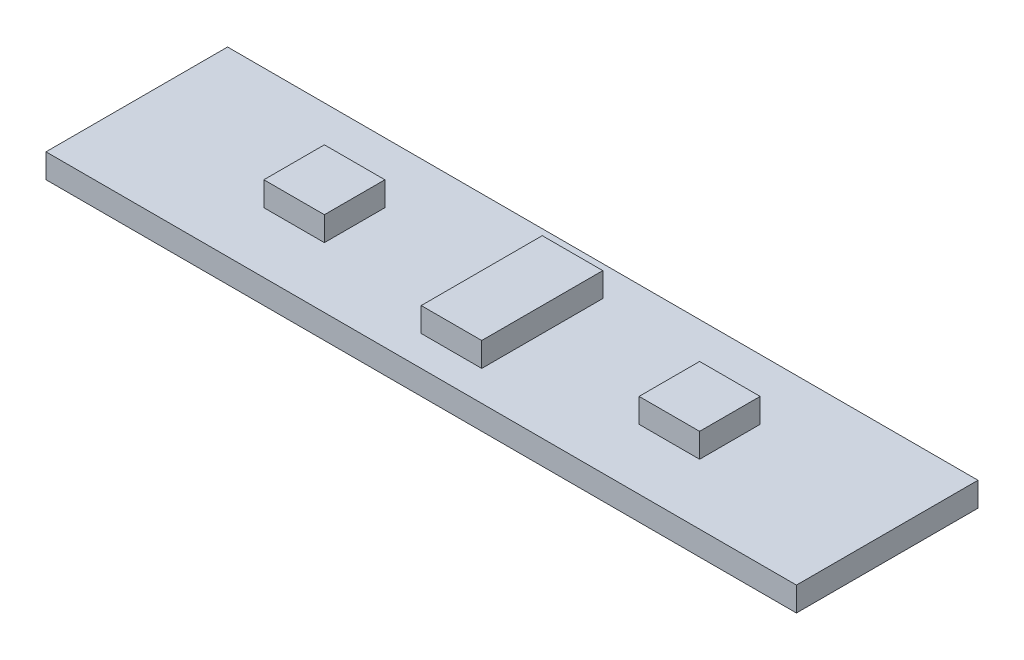
ISO-10303-21;
HEADER;
FILE_DESCRIPTION(('STEP AP214'),'2;1');
FILE_NAME('part.step','',(''),(''),'','','');
FILE_SCHEMA(('AUTOMOTIVE_DESIGN { 1 0 10303 214 1 1 1 1 }'));
ENDSEC;
DATA;
#1=APPLICATION_CONTEXT('core data for automotive mechanical design processes');
#2=APPLICATION_PROTOCOL_DEFINITION('international standard','automotive_design',2000,#1);
#3=PRODUCT_CONTEXT('',#1,'mechanical');
#4=PRODUCT('Part','Part','',(#3));
#5=PRODUCT_RELATED_PRODUCT_CATEGORY('part','',(#4));
#6=PRODUCT_DEFINITION_FORMATION('','',#4);
#7=PRODUCT_DEFINITION_CONTEXT('part definition',#1,'design');
#8=PRODUCT_DEFINITION('design','',#6,#7);
#9=PRODUCT_DEFINITION_SHAPE('','',#8);
#10=(LENGTH_UNIT() NAMED_UNIT(*) SI_UNIT(.MILLI.,.METRE.));
#11=(NAMED_UNIT(*) PLANE_ANGLE_UNIT() SI_UNIT($,.RADIAN.));
#12=(NAMED_UNIT(*) SI_UNIT($,.STERADIAN.) SOLID_ANGLE_UNIT());
#13=UNCERTAINTY_MEASURE_WITH_UNIT(LENGTH_MEASURE(1.E-05),#10,'distance_accuracy_value','');
#14=(GEOMETRIC_REPRESENTATION_CONTEXT(3) GLOBAL_UNCERTAINTY_ASSIGNED_CONTEXT((#13)) GLOBAL_UNIT_ASSIGNED_CONTEXT((#10,
#11,#12)) REPRESENTATION_CONTEXT('',''));
#15=CARTESIAN_POINT('',(0.,0.,0.));
#16=DIRECTION('',(0.,0.,1.));
#17=DIRECTION('',(1.,0.,0.));
#18=AXIS2_PLACEMENT_3D('',#15,#16,#17);
#19=CARTESIAN_POINT('',(0.,2.,-15.));
#20=DIRECTION('',(0.,-1.,0.));
#21=DIRECTION('',(0.,0.,-1.));
#22=AXIS2_PLACEMENT_3D('',#19,#20,#21);
#23=PLANE('',#22);
#24=DIRECTION('',(0.,0.,-1.));
#25=VECTOR('',#24,1.);
#26=CARTESIAN_POINT('',(49.,2.,-10.));
#27=LINE('',#26,#25);
#28=CARTESIAN_POINT('',(49.,2.,-5.));
#29=VERTEX_POINT('',#28);
#30=CARTESIAN_POINT('',(49.,2.,-10.));
#31=VERTEX_POINT('',#30);
#32=EDGE_CURVE('E179',#29,#31,#27,.T.);
#33=ORIENTED_EDGE('',*,*,#32,.F.);
#34=DIRECTION('',(1.,0.,0.));
#35=VECTOR('',#34,1.);
#36=CARTESIAN_POINT('',(49.,2.,-5.));
#37=LINE('',#36,#35);
#38=CARTESIAN_POINT('',(44.,2.,-5.));
#39=VERTEX_POINT('',#38);
#40=EDGE_CURVE('E192',#39,#29,#37,.T.);
#41=ORIENTED_EDGE('',*,*,#40,.F.);
#42=DIRECTION('',(0.,0.,1.));
#43=VECTOR('',#42,1.);
#44=CARTESIAN_POINT('',(44.,2.,-10.));
#45=LINE('',#44,#43);
#46=CARTESIAN_POINT('',(44.,2.,-10.));
#47=VERTEX_POINT('',#46);
#48=EDGE_CURVE('E201',#47,#39,#45,.T.);
#49=ORIENTED_EDGE('',*,*,#48,.F.);
#50=DIRECTION('',(-1.,0.,0.));
#51=VECTOR('',#50,1.);
#52=CARTESIAN_POINT('',(49.,2.,-10.));
#53=LINE('',#52,#51);
#54=EDGE_CURVE('E182',#31,#47,#53,.T.);
#55=ORIENTED_EDGE('',*,*,#54,.F.);
#56=EDGE_LOOP('',(#33,#41,#49,#55));
#57=FACE_BOUND('',#56,.T.);
#58=DIRECTION('',(0.,0.,1.));
#59=VECTOR('',#58,1.);
#60=CARTESIAN_POINT('',(0.,2.,0.));
#61=LINE('',#60,#59);
#62=CARTESIAN_POINT('',(0.,2.,-15.));
#63=VERTEX_POINT('',#62);
#64=CARTESIAN_POINT('',(0.,2.,0.));
#65=VERTEX_POINT('',#64);
#66=EDGE_CURVE('E251',#63,#65,#61,.T.);
#67=ORIENTED_EDGE('',*,*,#66,.T.);
#68=DIRECTION('',(1.,0.,0.));
#69=VECTOR('',#68,1.);
#70=CARTESIAN_POINT('',(0.,2.,0.));
#71=LINE('',#70,#69);
#72=CARTESIAN_POINT('',(62.,2.,0.));
#73=VERTEX_POINT('',#72);
#74=EDGE_CURVE('E254',#65,#73,#71,.T.);
#75=ORIENTED_EDGE('',*,*,#74,.T.);
#76=DIRECTION('',(0.,0.,-1.));
#77=VECTOR('',#76,1.);
#78=CARTESIAN_POINT('',(62.,2.,0.));
#79=LINE('',#78,#77);
#80=CARTESIAN_POINT('',(62.,2.,-15.));
#81=VERTEX_POINT('',#80);
#82=EDGE_CURVE('E257',#73,#81,#79,.T.);
#83=ORIENTED_EDGE('',*,*,#82,.T.);
#84=DIRECTION('',(-1.,0.,0.));
#85=VECTOR('',#84,1.);
#86=CARTESIAN_POINT('',(0.,2.,-15.));
#87=LINE('',#86,#85);
#88=EDGE_CURVE('E259',#81,#63,#87,.T.);
#89=ORIENTED_EDGE('',*,*,#88,.T.);
#90=EDGE_LOOP('',(#67,#75,#83,#89));
#91=FACE_BOUND('',#90,.T.);
#92=DIRECTION('',(0.,0.,1.));
#93=VECTOR('',#92,1.);
#94=CARTESIAN_POINT('',(13.,2.,-10.));
#95=LINE('',#94,#93);
#96=CARTESIAN_POINT('',(13.,2.,-10.));
#97=VERTEX_POINT('',#96);
#98=CARTESIAN_POINT('',(13.,2.,-5.));
#99=VERTEX_POINT('',#98);
#100=EDGE_CURVE('E217',#97,#99,#95,.T.);
#101=ORIENTED_EDGE('',*,*,#100,.F.);
#102=DIRECTION('',(-1.,0.,0.));
#103=VECTOR('',#102,1.);
#104=CARTESIAN_POINT('',(13.,2.,-10.));
#105=LINE('',#104,#103);
#106=CARTESIAN_POINT('',(18.,2.,-10.));
#107=VERTEX_POINT('',#106);
#108=EDGE_CURVE('E222',#107,#97,#105,.T.);
#109=ORIENTED_EDGE('',*,*,#108,.F.);
#110=DIRECTION('',(0.,0.,-1.));
#111=VECTOR('',#110,1.);
#112=CARTESIAN_POINT('',(18.,2.,-10.));
#113=LINE('',#112,#111);
#114=CARTESIAN_POINT('',(18.,2.,-5.));
#115=VERTEX_POINT('',#114);
#116=EDGE_CURVE('E234',#115,#107,#113,.T.);
#117=ORIENTED_EDGE('',*,*,#116,.F.);
#118=DIRECTION('',(1.,0.,0.));
#119=VECTOR('',#118,1.);
#120=CARTESIAN_POINT('',(13.,2.,-5.));
#121=LINE('',#120,#119);
#122=EDGE_CURVE('E231',#99,#115,#121,.T.);
#123=ORIENTED_EDGE('',*,*,#122,.F.);
#124=EDGE_LOOP('',(#101,#109,#117,#123));
#125=FACE_BOUND('',#124,.T.);
#126=DIRECTION('',(0.,0.,-1.));
#127=VECTOR('',#126,1.);
#128=CARTESIAN_POINT('',(33.5,2.,-12.5));
#129=LINE('',#128,#127);
#130=CARTESIAN_POINT('',(33.5,2.,-2.5));
#131=VERTEX_POINT('',#130);
#132=CARTESIAN_POINT('',(33.5,2.,-12.5));
#133=VERTEX_POINT('',#132);
#134=EDGE_CURVE('E510',#131,#133,#129,.T.);
#135=ORIENTED_EDGE('',*,*,#134,.F.);
#136=DIRECTION('',(1.,0.,0.));
#137=VECTOR('',#136,1.);
#138=CARTESIAN_POINT('',(31.,2.,-2.5));
#139=LINE('',#138,#137);
#140=CARTESIAN_POINT('',(28.5,2.,-2.5));
#141=VERTEX_POINT('',#140);
#142=EDGE_CURVE('E175',#141,#131,#139,.T.);
#143=ORIENTED_EDGE('',*,*,#142,.F.);
#144=DIRECTION('',(0.,0.,1.));
#145=VECTOR('',#144,1.);
#146=CARTESIAN_POINT('',(28.5,2.,-2.5));
#147=LINE('',#146,#145);
#148=CARTESIAN_POINT('',(28.5,2.,-12.5));
#149=VERTEX_POINT('',#148);
#150=EDGE_CURVE('E65',#149,#141,#147,.T.);
#151=ORIENTED_EDGE('',*,*,#150,.F.);
#152=DIRECTION('',(-1.,0.,0.));
#153=VECTOR('',#152,1.);
#154=CARTESIAN_POINT('',(28.5,2.,-12.5));
#155=LINE('',#154,#153);
#156=EDGE_CURVE('E60',#133,#149,#155,.T.);
#157=ORIENTED_EDGE('',*,*,#156,.F.);
#158=EDGE_LOOP('',(#135,#143,#151,#157));
#159=FACE_BOUND('',#158,.T.);
#160=ADVANCED_FACE('F45',(#57,#91,#125,#159),#23,.F.);
#161=CARTESIAN_POINT('',(0.,2.,0.));
#162=DIRECTION('',(1.,0.,0.));
#163=DIRECTION('',(0.,0.,-1.));
#164=AXIS2_PLACEMENT_3D('',#161,#162,#163);
#165=PLANE('',#164);
#166=DIRECTION('',(0.,0.,1.));
#167=VECTOR('',#166,1.);
#168=CARTESIAN_POINT('',(0.,0.,0.));
#169=LINE('',#168,#167);
#170=CARTESIAN_POINT('',(0.,0.,-15.));
#171=VERTEX_POINT('',#170);
#172=CARTESIAN_POINT('',(0.,0.,0.));
#173=VERTEX_POINT('',#172);
#174=EDGE_CURVE('E250',#171,#173,#169,.T.);
#175=ORIENTED_EDGE('',*,*,#174,.T.);
#176=DIRECTION('',(0.,-1.,0.));
#177=VECTOR('',#176,1.);
#178=CARTESIAN_POINT('',(0.,2.,0.));
#179=LINE('',#178,#177);
#180=EDGE_CURVE('E11',#65,#173,#179,.T.);
#181=ORIENTED_EDGE('',*,*,#180,.F.);
#182=ORIENTED_EDGE('',*,*,#66,.F.);
#183=DIRECTION('',(0.,-1.,0.));
#184=VECTOR('',#183,1.);
#185=CARTESIAN_POINT('',(0.,2.,-15.));
#186=LINE('',#185,#184);
#187=EDGE_CURVE('E261',#63,#171,#186,.T.);
#188=ORIENTED_EDGE('',*,*,#187,.T.);
#189=EDGE_LOOP('',(#175,#181,#182,#188));
#190=FACE_BOUND('',#189,.T.);
#191=ADVANCED_FACE('F47',(#190),#165,.F.);
#192=CARTESIAN_POINT('',(0.,2.,0.));
#193=DIRECTION('',(0.,0.,-1.));
#194=DIRECTION('',(-1.,0.,0.));
#195=AXIS2_PLACEMENT_3D('',#192,#193,#194);
#196=PLANE('',#195);
#197=DIRECTION('',(1.,0.,0.));
#198=VECTOR('',#197,1.);
#199=CARTESIAN_POINT('',(0.,0.,0.));
#200=LINE('',#199,#198);
#201=CARTESIAN_POINT('',(62.,0.,0.));
#202=VERTEX_POINT('',#201);
#203=EDGE_CURVE('E264',#173,#202,#200,.T.);
#204=ORIENTED_EDGE('',*,*,#203,.T.);
#205=DIRECTION('',(0.,-1.,0.));
#206=VECTOR('',#205,1.);
#207=CARTESIAN_POINT('',(62.,2.,0.));
#208=LINE('',#207,#206);
#209=EDGE_CURVE('E53',#73,#202,#208,.T.);
#210=ORIENTED_EDGE('',*,*,#209,.F.);
#211=ORIENTED_EDGE('',*,*,#74,.F.);
#212=ORIENTED_EDGE('',*,*,#180,.T.);
#213=EDGE_LOOP('',(#204,#210,#211,#212));
#214=FACE_BOUND('',#213,.T.);
#215=ADVANCED_FACE('F294',(#214),#196,.F.);
#216=CARTESIAN_POINT('',(62.,2.,0.));
#217=DIRECTION('',(-1.,0.,0.));
#218=DIRECTION('',(0.,0.,1.));
#219=AXIS2_PLACEMENT_3D('',#216,#217,#218);
#220=PLANE('',#219);
#221=DIRECTION('',(0.,0.,-1.));
#222=VECTOR('',#221,1.);
#223=CARTESIAN_POINT('',(62.,0.,0.));
#224=LINE('',#223,#222);
#225=CARTESIAN_POINT('',(62.,0.,-15.));
#226=VERTEX_POINT('',#225);
#227=EDGE_CURVE('E266',#202,#226,#224,.T.);
#228=ORIENTED_EDGE('',*,*,#227,.T.);
#229=DIRECTION('',(0.,-1.,0.));
#230=VECTOR('',#229,1.);
#231=CARTESIAN_POINT('',(62.,2.,-15.));
#232=LINE('',#231,#230);
#233=EDGE_CURVE('E271',#81,#226,#232,.T.);
#234=ORIENTED_EDGE('',*,*,#233,.F.);
#235=ORIENTED_EDGE('',*,*,#82,.F.);
#236=ORIENTED_EDGE('',*,*,#209,.T.);
#237=EDGE_LOOP('',(#228,#234,#235,#236));
#238=FACE_BOUND('',#237,.T.);
#239=ADVANCED_FACE('F278',(#238),#220,.F.);
#240=CARTESIAN_POINT('',(0.,2.,-15.));
#241=DIRECTION('',(0.,0.,1.));
#242=DIRECTION('',(1.,0.,0.));
#243=AXIS2_PLACEMENT_3D('',#240,#241,#242);
#244=PLANE('',#243);
#245=DIRECTION('',(-1.,0.,0.));
#246=VECTOR('',#245,1.);
#247=CARTESIAN_POINT('',(0.,0.,-15.));
#248=LINE('',#247,#246);
#249=EDGE_CURVE('E255',#226,#171,#248,.T.);
#250=ORIENTED_EDGE('',*,*,#249,.T.);
#251=ORIENTED_EDGE('',*,*,#187,.F.);
#252=ORIENTED_EDGE('',*,*,#88,.F.);
#253=ORIENTED_EDGE('',*,*,#233,.T.);
#254=EDGE_LOOP('',(#250,#251,#252,#253));
#255=FACE_BOUND('',#254,.T.);
#256=ADVANCED_FACE('F287',(#255),#244,.F.);
#257=CARTESIAN_POINT('',(0.,0.,-15.));
#258=DIRECTION('',(0.,-1.,0.));
#259=DIRECTION('',(0.,0.,-1.));
#260=AXIS2_PLACEMENT_3D('',#257,#258,#259);
#261=PLANE('',#260);
#262=ORIENTED_EDGE('',*,*,#174,.F.);
#263=ORIENTED_EDGE('',*,*,#249,.F.);
#264=ORIENTED_EDGE('',*,*,#227,.F.);
#265=ORIENTED_EDGE('',*,*,#203,.F.);
#266=EDGE_LOOP('',(#262,#263,#264,#265));
#267=FACE_BOUND('',#266,.T.);
#268=ADVANCED_FACE('F284',(#267),#261,.T.);
#269=CARTESIAN_POINT('',(13.,4.,-10.));
#270=DIRECTION('',(1.,0.,0.));
#271=DIRECTION('',(0.,0.,-1.));
#272=AXIS2_PLACEMENT_3D('',#269,#270,#271);
#273=PLANE('',#272);
#274=ORIENTED_EDGE('',*,*,#100,.T.);
#275=DIRECTION('',(0.,-1.,0.));
#276=VECTOR('',#275,1.);
#277=CARTESIAN_POINT('',(13.,4.,-5.));
#278=LINE('',#277,#276);
#279=CARTESIAN_POINT('',(13.,4.,-5.));
#280=VERTEX_POINT('',#279);
#281=EDGE_CURVE('E247',#280,#99,#278,.T.);
#282=ORIENTED_EDGE('',*,*,#281,.F.);
#283=DIRECTION('',(0.,0.,1.));
#284=VECTOR('',#283,1.);
#285=CARTESIAN_POINT('',(13.,4.,-10.));
#286=LINE('',#285,#284);
#287=CARTESIAN_POINT('',(13.,4.,-10.));
#288=VERTEX_POINT('',#287);
#289=EDGE_CURVE('E218',#288,#280,#286,.T.);
#290=ORIENTED_EDGE('',*,*,#289,.F.);
#291=DIRECTION('',(0.,-1.,0.));
#292=VECTOR('',#291,1.);
#293=CARTESIAN_POINT('',(13.,4.,-10.));
#294=LINE('',#293,#292);
#295=EDGE_CURVE('E228',#288,#97,#294,.T.);
#296=ORIENTED_EDGE('',*,*,#295,.T.);
#297=EDGE_LOOP('',(#274,#282,#290,#296));
#298=FACE_BOUND('',#297,.T.);
#299=ADVANCED_FACE('F310',(#298),#273,.F.);
#300=CARTESIAN_POINT('',(13.,4.,-5.));
#301=DIRECTION('',(0.,0.,-1.));
#302=DIRECTION('',(-1.,0.,0.));
#303=AXIS2_PLACEMENT_3D('',#300,#301,#302);
#304=PLANE('',#303);
#305=ORIENTED_EDGE('',*,*,#122,.T.);
#306=DIRECTION('',(0.,-1.,0.));
#307=VECTOR('',#306,1.);
#308=CARTESIAN_POINT('',(18.,4.,-5.));
#309=LINE('',#308,#307);
#310=CARTESIAN_POINT('',(18.,4.,-5.));
#311=VERTEX_POINT('',#310);
#312=EDGE_CURVE('E244',#311,#115,#309,.T.);
#313=ORIENTED_EDGE('',*,*,#312,.F.);
#314=DIRECTION('',(1.,0.,0.));
#315=VECTOR('',#314,1.);
#316=CARTESIAN_POINT('',(13.,4.,-5.));
#317=LINE('',#316,#315);
#318=EDGE_CURVE('E221',#280,#311,#317,.T.);
#319=ORIENTED_EDGE('',*,*,#318,.F.);
#320=ORIENTED_EDGE('',*,*,#281,.T.);
#321=EDGE_LOOP('',(#305,#313,#319,#320));
#322=FACE_BOUND('',#321,.T.);
#323=ADVANCED_FACE('F333',(#322),#304,.F.);
#324=CARTESIAN_POINT('',(18.,4.,-10.));
#325=DIRECTION('',(-1.,0.,0.));
#326=DIRECTION('',(0.,0.,1.));
#327=AXIS2_PLACEMENT_3D('',#324,#325,#326);
#328=PLANE('',#327);
#329=ORIENTED_EDGE('',*,*,#116,.T.);
#330=DIRECTION('',(0.,-1.,0.));
#331=VECTOR('',#330,1.);
#332=CARTESIAN_POINT('',(18.,4.,-10.));
#333=LINE('',#332,#331);
#334=CARTESIAN_POINT('',(18.,4.,-10.));
#335=VERTEX_POINT('',#334);
#336=EDGE_CURVE('E241',#335,#107,#333,.T.);
#337=ORIENTED_EDGE('',*,*,#336,.F.);
#338=DIRECTION('',(0.,0.,-1.));
#339=VECTOR('',#338,1.);
#340=CARTESIAN_POINT('',(18.,4.,-10.));
#341=LINE('',#340,#339);
#342=EDGE_CURVE('E224',#311,#335,#341,.T.);
#343=ORIENTED_EDGE('',*,*,#342,.F.);
#344=ORIENTED_EDGE('',*,*,#312,.T.);
#345=EDGE_LOOP('',(#329,#337,#343,#344));
#346=FACE_BOUND('',#345,.T.);
#347=ADVANCED_FACE('F340',(#346),#328,.F.);
#348=CARTESIAN_POINT('',(13.,4.,-10.));
#349=DIRECTION('',(0.,0.,1.));
#350=DIRECTION('',(1.,0.,0.));
#351=AXIS2_PLACEMENT_3D('',#348,#349,#350);
#352=PLANE('',#351);
#353=ORIENTED_EDGE('',*,*,#108,.T.);
#354=ORIENTED_EDGE('',*,*,#295,.F.);
#355=DIRECTION('',(-1.,0.,0.));
#356=VECTOR('',#355,1.);
#357=CARTESIAN_POINT('',(13.,4.,-10.));
#358=LINE('',#357,#356);
#359=EDGE_CURVE('E226',#335,#288,#358,.T.);
#360=ORIENTED_EDGE('',*,*,#359,.F.);
#361=ORIENTED_EDGE('',*,*,#336,.T.);
#362=EDGE_LOOP('',(#353,#354,#360,#361));
#363=FACE_BOUND('',#362,.T.);
#364=ADVANCED_FACE('F348',(#363),#352,.F.);
#365=CARTESIAN_POINT('',(13.,4.,-5.));
#366=DIRECTION('',(0.,1.,0.));
#367=DIRECTION('',(0.,0.,1.));
#368=AXIS2_PLACEMENT_3D('',#365,#366,#367);
#369=PLANE('',#368);
#370=ORIENTED_EDGE('',*,*,#289,.T.);
#371=ORIENTED_EDGE('',*,*,#318,.T.);
#372=ORIENTED_EDGE('',*,*,#342,.T.);
#373=ORIENTED_EDGE('',*,*,#359,.T.);
#374=EDGE_LOOP('',(#370,#371,#372,#373));
#375=FACE_BOUND('',#374,.T.);
#376=ADVANCED_FACE('F357',(#375),#369,.T.);
#377=CARTESIAN_POINT('',(49.,4.,-10.));
#378=DIRECTION('',(-1.,0.,0.));
#379=DIRECTION('',(0.,0.,1.));
#380=AXIS2_PLACEMENT_3D('',#377,#378,#379);
#381=PLANE('',#380);
#382=ORIENTED_EDGE('',*,*,#32,.T.);
#383=DIRECTION('',(0.,-1.,0.));
#384=VECTOR('',#383,1.);
#385=CARTESIAN_POINT('',(49.,4.,-10.));
#386=LINE('',#385,#384);
#387=CARTESIAN_POINT('',(49.,4.,-10.));
#388=VERTEX_POINT('',#387);
#389=EDGE_CURVE('E214',#388,#31,#386,.T.);
#390=ORIENTED_EDGE('',*,*,#389,.F.);
#391=DIRECTION('',(0.,0.,-1.));
#392=VECTOR('',#391,1.);
#393=CARTESIAN_POINT('',(49.,4.,-10.));
#394=LINE('',#393,#392);
#395=CARTESIAN_POINT('',(49.,4.,-5.));
#396=VERTEX_POINT('',#395);
#397=EDGE_CURVE('E188',#396,#388,#394,.T.);
#398=ORIENTED_EDGE('',*,*,#397,.F.);
#399=DIRECTION('',(0.,-1.,0.));
#400=VECTOR('',#399,1.);
#401=CARTESIAN_POINT('',(49.,4.,-5.));
#402=LINE('',#401,#400);
#403=EDGE_CURVE('E197',#396,#29,#402,.T.);
#404=ORIENTED_EDGE('',*,*,#403,.T.);
#405=EDGE_LOOP('',(#382,#390,#398,#404));
#406=FACE_BOUND('',#405,.T.);
#407=ADVANCED_FACE('F364',(#406),#381,.F.);
#408=CARTESIAN_POINT('',(49.,4.,-10.));
#409=DIRECTION('',(0.,0.,1.));
#410=DIRECTION('',(1.,0.,0.));
#411=AXIS2_PLACEMENT_3D('',#408,#409,#410);
#412=PLANE('',#411);
#413=ORIENTED_EDGE('',*,*,#54,.T.);
#414=DIRECTION('',(0.,-1.,0.));
#415=VECTOR('',#414,1.);
#416=CARTESIAN_POINT('',(44.,4.,-10.));
#417=LINE('',#416,#415);
#418=CARTESIAN_POINT('',(44.,4.,-10.));
#419=VERTEX_POINT('',#418);
#420=EDGE_CURVE('E211',#419,#47,#417,.T.);
#421=ORIENTED_EDGE('',*,*,#420,.F.);
#422=DIRECTION('',(-1.,0.,0.));
#423=VECTOR('',#422,1.);
#424=CARTESIAN_POINT('',(49.,4.,-10.));
#425=LINE('',#424,#423);
#426=EDGE_CURVE('E191',#388,#419,#425,.T.);
#427=ORIENTED_EDGE('',*,*,#426,.F.);
#428=ORIENTED_EDGE('',*,*,#389,.T.);
#429=EDGE_LOOP('',(#413,#421,#427,#428));
#430=FACE_BOUND('',#429,.T.);
#431=ADVANCED_FACE('F373',(#430),#412,.F.);
#432=CARTESIAN_POINT('',(44.,4.,-10.));
#433=DIRECTION('',(1.,0.,0.));
#434=DIRECTION('',(0.,0.,-1.));
#435=AXIS2_PLACEMENT_3D('',#432,#433,#434);
#436=PLANE('',#435);
#437=ORIENTED_EDGE('',*,*,#48,.T.);
#438=DIRECTION('',(0.,-1.,0.));
#439=VECTOR('',#438,1.);
#440=CARTESIAN_POINT('',(44.,4.,-5.));
#441=LINE('',#440,#439);
#442=CARTESIAN_POINT('',(44.,4.,-5.));
#443=VERTEX_POINT('',#442);
#444=EDGE_CURVE('E208',#443,#39,#441,.T.);
#445=ORIENTED_EDGE('',*,*,#444,.F.);
#446=DIRECTION('',(0.,0.,1.));
#447=VECTOR('',#446,1.);
#448=CARTESIAN_POINT('',(44.,4.,-10.));
#449=LINE('',#448,#447);
#450=EDGE_CURVE('E194',#419,#443,#449,.T.);
#451=ORIENTED_EDGE('',*,*,#450,.F.);
#452=ORIENTED_EDGE('',*,*,#420,.T.);
#453=EDGE_LOOP('',(#437,#445,#451,#452));
#454=FACE_BOUND('',#453,.T.);
#455=ADVANCED_FACE('F381',(#454),#436,.F.);
#456=CARTESIAN_POINT('',(49.,4.,-5.));
#457=DIRECTION('',(0.,0.,-1.));
#458=DIRECTION('',(-1.,0.,0.));
#459=AXIS2_PLACEMENT_3D('',#456,#457,#458);
#460=PLANE('',#459);
#461=ORIENTED_EDGE('',*,*,#40,.T.);
#462=ORIENTED_EDGE('',*,*,#403,.F.);
#463=DIRECTION('',(1.,0.,0.));
#464=VECTOR('',#463,1.);
#465=CARTESIAN_POINT('',(49.,4.,-5.));
#466=LINE('',#465,#464);
#467=EDGE_CURVE('E196',#443,#396,#466,.T.);
#468=ORIENTED_EDGE('',*,*,#467,.F.);
#469=ORIENTED_EDGE('',*,*,#444,.T.);
#470=EDGE_LOOP('',(#461,#462,#468,#469));
#471=FACE_BOUND('',#470,.T.);
#472=ADVANCED_FACE('F388',(#471),#460,.F.);
#473=CARTESIAN_POINT('',(49.,4.,-5.));
#474=DIRECTION('',(0.,-1.,0.));
#475=DIRECTION('',(0.,0.,-1.));
#476=AXIS2_PLACEMENT_3D('',#473,#474,#475);
#477=PLANE('',#476);
#478=ORIENTED_EDGE('',*,*,#397,.T.);
#479=ORIENTED_EDGE('',*,*,#426,.T.);
#480=ORIENTED_EDGE('',*,*,#450,.T.);
#481=ORIENTED_EDGE('',*,*,#467,.T.);
#482=EDGE_LOOP('',(#478,#479,#480,#481));
#483=FACE_BOUND('',#482,.T.);
#484=ADVANCED_FACE('F396',(#483),#477,.F.);
#485=CARTESIAN_POINT('',(33.5,4.,-12.5));
#486=DIRECTION('',(-1.,0.,0.));
#487=DIRECTION('',(0.,0.,1.));
#488=AXIS2_PLACEMENT_3D('',#485,#486,#487);
#489=PLANE('',#488);
#490=ORIENTED_EDGE('',*,*,#134,.T.);
#491=DIRECTION('',(0.,-1.,0.));
#492=VECTOR('',#491,1.);
#493=CARTESIAN_POINT('',(33.5,4.,-12.5));
#494=LINE('',#493,#492);
#495=CARTESIAN_POINT('',(33.5,4.,-12.5));
#496=VERTEX_POINT('',#495);
#497=EDGE_CURVE('E162',#496,#133,#494,.T.);
#498=ORIENTED_EDGE('',*,*,#497,.F.);
#499=DIRECTION('',(0.,0.,-1.));
#500=VECTOR('',#499,1.);
#501=CARTESIAN_POINT('',(33.5,4.,-12.5));
#502=LINE('',#501,#500);
#503=CARTESIAN_POINT('',(33.5,4.,-2.5));
#504=VERTEX_POINT('',#503);
#505=EDGE_CURVE('E156',#504,#496,#502,.T.);
#506=ORIENTED_EDGE('',*,*,#505,.F.);
#507=DIRECTION('',(0.,-1.,0.));
#508=VECTOR('',#507,1.);
#509=CARTESIAN_POINT('',(33.5,4.,-2.5));
#510=LINE('',#509,#508);
#511=EDGE_CURVE('E160',#504,#131,#510,.T.);
#512=ORIENTED_EDGE('',*,*,#511,.T.);
#513=EDGE_LOOP('',(#490,#498,#506,#512));
#514=FACE_BOUND('',#513,.T.);
#515=ADVANCED_FACE('F158',(#514),#489,.F.);
#516=CARTESIAN_POINT('',(28.5,4.,-12.5));
#517=DIRECTION('',(0.,0.,1.));
#518=DIRECTION('',(1.,0.,0.));
#519=AXIS2_PLACEMENT_3D('',#516,#517,#518);
#520=PLANE('',#519);
#521=ORIENTED_EDGE('',*,*,#156,.T.);
#522=DIRECTION('',(0.,-1.,0.));
#523=VECTOR('',#522,1.);
#524=CARTESIAN_POINT('',(28.5,4.,-12.5));
#525=LINE('',#524,#523);
#526=CARTESIAN_POINT('',(28.5,4.,-12.5));
#527=VERTEX_POINT('',#526);
#528=EDGE_CURVE('E184',#527,#149,#525,.T.);
#529=ORIENTED_EDGE('',*,*,#528,.F.);
#530=DIRECTION('',(-1.,0.,0.));
#531=VECTOR('',#530,1.);
#532=CARTESIAN_POINT('',(28.5,4.,-12.5));
#533=LINE('',#532,#531);
#534=EDGE_CURVE('E165',#496,#527,#533,.T.);
#535=ORIENTED_EDGE('',*,*,#534,.F.);
#536=ORIENTED_EDGE('',*,*,#497,.T.);
#537=EDGE_LOOP('',(#521,#529,#535,#536));
#538=FACE_BOUND('',#537,.T.);
#539=ADVANCED_FACE('F410',(#538),#520,.F.);
#540=CARTESIAN_POINT('',(28.5,4.,-2.5));
#541=DIRECTION('',(1.,0.,0.));
#542=DIRECTION('',(0.,0.,-1.));
#543=AXIS2_PLACEMENT_3D('',#540,#541,#542);
#544=PLANE('',#543);
#545=ORIENTED_EDGE('',*,*,#150,.T.);
#546=DIRECTION('',(0.,-1.,0.));
#547=VECTOR('',#546,1.);
#548=CARTESIAN_POINT('',(28.5,4.,-2.5));
#549=LINE('',#548,#547);
#550=CARTESIAN_POINT('',(28.5,4.,-2.5));
#551=VERTEX_POINT('',#550);
#552=EDGE_CURVE('E502',#551,#141,#549,.T.);
#553=ORIENTED_EDGE('',*,*,#552,.F.);
#554=DIRECTION('',(0.,0.,1.));
#555=VECTOR('',#554,1.);
#556=CARTESIAN_POINT('',(28.5,4.,-2.5));
#557=LINE('',#556,#555);
#558=EDGE_CURVE('E171',#527,#551,#557,.T.);
#559=ORIENTED_EDGE('',*,*,#558,.F.);
#560=ORIENTED_EDGE('',*,*,#528,.T.);
#561=EDGE_LOOP('',(#545,#553,#559,#560));
#562=FACE_BOUND('',#561,.T.);
#563=ADVANCED_FACE('F418',(#562),#544,.F.);
#564=CARTESIAN_POINT('',(31.,4.,-2.5));
#565=DIRECTION('',(0.,0.,-1.));
#566=DIRECTION('',(-1.,0.,0.));
#567=AXIS2_PLACEMENT_3D('',#564,#565,#566);
#568=PLANE('',#567);
#569=ORIENTED_EDGE('',*,*,#142,.T.);
#570=ORIENTED_EDGE('',*,*,#511,.F.);
#571=DIRECTION('',(1.,0.,0.));
#572=VECTOR('',#571,1.);
#573=CARTESIAN_POINT('',(33.5,4.,-2.5));
#574=LINE('',#573,#572);
#575=EDGE_CURVE('E166',#551,#504,#574,.T.);
#576=ORIENTED_EDGE('',*,*,#575,.F.);
#577=ORIENTED_EDGE('',*,*,#552,.T.);
#578=EDGE_LOOP('',(#569,#570,#576,#577));
#579=FACE_BOUND('',#578,.T.);
#580=ADVANCED_FACE('F178',(#579),#568,.F.);
#581=CARTESIAN_POINT('',(28.5,4.,-2.5));
#582=DIRECTION('',(0.,-1.,0.));
#583=DIRECTION('',(0.,0.,-1.));
#584=AXIS2_PLACEMENT_3D('',#581,#582,#583);
#585=PLANE('',#584);
#586=ORIENTED_EDGE('',*,*,#575,.T.);
#587=ORIENTED_EDGE('',*,*,#505,.T.);
#588=ORIENTED_EDGE('',*,*,#534,.T.);
#589=ORIENTED_EDGE('',*,*,#558,.T.);
#590=EDGE_LOOP('',(#586,#587,#588,#589));
#591=FACE_BOUND('',#590,.T.);
#592=ADVANCED_FACE('F169',(#591),#585,.F.);
#593=CLOSED_SHELL('',(#160,#191,#215,#239,#256,#268,#299,#323,#347,#364,#376,#407,#431,#455,
#472,#484,#515,#539,#563,#580,#592));
#594=MANIFOLD_SOLID_BREP('B2',#593);
#595=ADVANCED_BREP_SHAPE_REPRESENTATION('',(#18,#594),#14);
#596=SHAPE_DEFINITION_REPRESENTATION(#9,#595);
ENDSEC;
END-ISO-10303-21;
